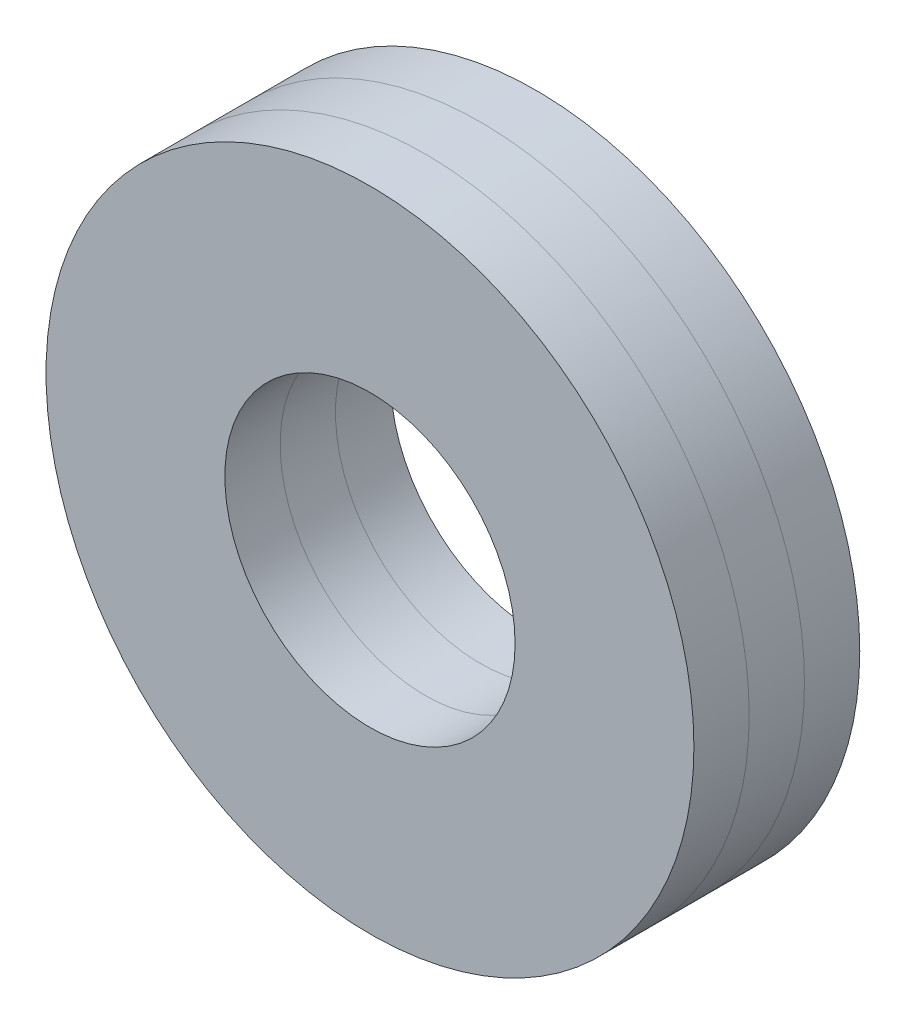
ISO-10303-21;
HEADER;
FILE_DESCRIPTION(('STEP AP214'),'2;1');
FILE_NAME('part.step','',(''),(''),'','','');
FILE_SCHEMA(('AUTOMOTIVE_DESIGN { 1 0 10303 214 1 1 1 1 }'));
ENDSEC;
DATA;
#1=APPLICATION_CONTEXT('core data for automotive mechanical design processes');
#2=APPLICATION_PROTOCOL_DEFINITION('international standard','automotive_design',2000,#1);
#3=PRODUCT_CONTEXT('',#1,'mechanical');
#4=PRODUCT('Part','Part','',(#3));
#5=PRODUCT_RELATED_PRODUCT_CATEGORY('part','',(#4));
#6=PRODUCT_DEFINITION_FORMATION('','',#4);
#7=PRODUCT_DEFINITION_CONTEXT('part definition',#1,'design');
#8=PRODUCT_DEFINITION('design','',#6,#7);
#9=PRODUCT_DEFINITION_SHAPE('','',#8);
#10=(LENGTH_UNIT() NAMED_UNIT(*) SI_UNIT(.MILLI.,.METRE.));
#11=(NAMED_UNIT(*) PLANE_ANGLE_UNIT() SI_UNIT($,.RADIAN.));
#12=(NAMED_UNIT(*) SI_UNIT($,.STERADIAN.) SOLID_ANGLE_UNIT());
#13=UNCERTAINTY_MEASURE_WITH_UNIT(LENGTH_MEASURE(1.E-05),#10,'distance_accuracy_value','');
#14=(GEOMETRIC_REPRESENTATION_CONTEXT(3) GLOBAL_UNCERTAINTY_ASSIGNED_CONTEXT((#13)) GLOBAL_UNIT_ASSIGNED_CONTEXT((#10,
#11,#12)) REPRESENTATION_CONTEXT('',''));
#15=CARTESIAN_POINT('',(0.,0.,0.));
#16=DIRECTION('',(0.,0.,1.));
#17=DIRECTION('',(1.,0.,0.));
#18=AXIS2_PLACEMENT_3D('',#15,#16,#17);
#19=CARTESIAN_POINT('',(0.,0.,-1.6256));
#20=DIRECTION('',(0.,0.,1.));
#21=DIRECTION('',(1.,0.,0.));
#22=AXIS2_PLACEMENT_3D('',#19,#20,#21);
#23=PLANE('',#22);
#24=CARTESIAN_POINT('',(0.,0.,-1.6256));
#25=DIRECTION('',(0.,0.,1.));
#26=DIRECTION('',(1.,0.,0.));
#27=AXIS2_PLACEMENT_3D('',#24,#25,#26);
#28=CIRCLE('',#27,2.1336);
#29=CARTESIAN_POINT('',(2.1336,0.,-1.6256));
#30=VERTEX_POINT('',#29);
#31=EDGE_CURVE('E48',#30,#30,#28,.F.);
#32=ORIENTED_EDGE('',*,*,#31,.T.);
#33=EDGE_LOOP('',(#32));
#34=FACE_BOUND('',#33,.T.);
#35=CARTESIAN_POINT('',(0.,0.,-1.6256));
#36=DIRECTION('',(0.,0.,1.));
#37=DIRECTION('',(1.,0.,0.));
#38=AXIS2_PLACEMENT_3D('',#35,#36,#37);
#39=CIRCLE('',#38,4.7625);
#40=CARTESIAN_POINT('',(4.7625,0.,-1.6256));
#41=VERTEX_POINT('',#40);
#42=EDGE_CURVE('E57',#41,#41,#39,.F.);
#43=ORIENTED_EDGE('',*,*,#42,.F.);
#44=EDGE_LOOP('',(#43));
#45=FACE_BOUND('',#44,.T.);
#46=ADVANCED_FACE('F44',(#34,#45),#23,.T.);
#47=CARTESIAN_POINT('',(0.,0.,-2.4384));
#48=DIRECTION('',(0.,0.,1.));
#49=DIRECTION('',(1.,0.,0.));
#50=AXIS2_PLACEMENT_3D('',#47,#48,#49);
#51=PLANE('',#50);
#52=CARTESIAN_POINT('',(0.,0.,-2.4384));
#53=DIRECTION('',(0.,0.,1.));
#54=DIRECTION('',(1.,0.,0.));
#55=AXIS2_PLACEMENT_3D('',#52,#53,#54);
#56=CIRCLE('',#55,2.1336);
#57=CARTESIAN_POINT('',(2.1336,0.,-2.4384));
#58=VERTEX_POINT('',#57);
#59=EDGE_CURVE('E12',#58,#58,#56,.T.);
#60=ORIENTED_EDGE('',*,*,#59,.T.);
#61=EDGE_LOOP('',(#60));
#62=FACE_BOUND('',#61,.T.);
#63=CARTESIAN_POINT('',(0.,0.,-2.4384));
#64=DIRECTION('',(0.,0.,1.));
#65=DIRECTION('',(1.,0.,0.));
#66=AXIS2_PLACEMENT_3D('',#63,#64,#65);
#67=CIRCLE('',#66,4.7625);
#68=CARTESIAN_POINT('',(4.7625,0.,-2.4384));
#69=VERTEX_POINT('',#68);
#70=EDGE_CURVE('E52',#69,#69,#67,.T.);
#71=ORIENTED_EDGE('',*,*,#70,.F.);
#72=EDGE_LOOP('',(#71));
#73=FACE_BOUND('',#72,.T.);
#74=ADVANCED_FACE('F69',(#62,#73),#51,.F.);
#75=CARTESIAN_POINT('',(0.,0.,-2.4384));
#76=DIRECTION('',(0.,0.,1.));
#77=DIRECTION('',(1.,0.,0.));
#78=AXIS2_PLACEMENT_3D('',#75,#76,#77);
#79=CYLINDRICAL_SURFACE('',#78,2.1336);
#80=ORIENTED_EDGE('',*,*,#59,.F.);
#81=EDGE_LOOP('',(#80));
#82=FACE_BOUND('',#81,.T.);
#83=ORIENTED_EDGE('',*,*,#31,.F.);
#84=EDGE_LOOP('',(#83));
#85=FACE_BOUND('',#84,.T.);
#86=ADVANCED_FACE('F67',(#82,#85),#79,.F.);
#87=CARTESIAN_POINT('',(0.,0.,-2.4384));
#88=DIRECTION('',(0.,0.,1.));
#89=DIRECTION('',(1.,0.,0.));
#90=AXIS2_PLACEMENT_3D('',#87,#88,#89);
#91=CYLINDRICAL_SURFACE('',#90,4.7625);
#92=ORIENTED_EDGE('',*,*,#70,.T.);
#93=EDGE_LOOP('',(#92));
#94=FACE_BOUND('',#93,.T.);
#95=ORIENTED_EDGE('',*,*,#42,.T.);
#96=EDGE_LOOP('',(#95));
#97=FACE_BOUND('',#96,.T.);
#98=ADVANCED_FACE('F46',(#94,#97),#91,.T.);
#99=CLOSED_SHELL('',(#46,#74,#86,#98));
#100=MANIFOLD_SOLID_BREP('B2',#99);
#101=CARTESIAN_POINT('',(0.,0.,-0.8128));
#102=DIRECTION('',(0.,0.,1.));
#103=DIRECTION('',(1.,0.,0.));
#104=AXIS2_PLACEMENT_3D('',#101,#102,#103);
#105=PLANE('',#104);
#106=CARTESIAN_POINT('',(0.,0.,-0.8128));
#107=DIRECTION('',(0.,0.,1.));
#108=DIRECTION('',(1.,0.,0.));
#109=AXIS2_PLACEMENT_3D('',#106,#107,#108);
#110=CIRCLE('',#109,4.7625);
#111=CARTESIAN_POINT('',(4.7625,0.,-0.8128));
#112=VERTEX_POINT('',#111);
#113=EDGE_CURVE('E117',#112,#112,#110,.F.);
#114=ORIENTED_EDGE('',*,*,#113,.T.);
#115=EDGE_LOOP('',(#114));
#116=FACE_BOUND('',#115,.T.);
#117=CARTESIAN_POINT('',(0.,0.,-0.8128));
#118=DIRECTION('',(0.,0.,1.));
#119=DIRECTION('',(1.,0.,0.));
#120=AXIS2_PLACEMENT_3D('',#117,#118,#119);
#121=CIRCLE('',#120,2.1336);
#122=CARTESIAN_POINT('',(2.1336,0.,-0.8128));
#123=VERTEX_POINT('',#122);
#124=EDGE_CURVE('E126',#123,#123,#121,.F.);
#125=ORIENTED_EDGE('',*,*,#124,.F.);
#126=EDGE_LOOP('',(#125));
#127=FACE_BOUND('',#126,.T.);
#128=ADVANCED_FACE('F113',(#116,#127),#105,.F.);
#129=CARTESIAN_POINT('',(0.,0.,0.));
#130=DIRECTION('',(0.,0.,1.));
#131=DIRECTION('',(1.,0.,0.));
#132=AXIS2_PLACEMENT_3D('',#129,#130,#131);
#133=PLANE('',#132);
#134=CARTESIAN_POINT('',(0.,0.,0.));
#135=DIRECTION('',(0.,0.,1.));
#136=DIRECTION('',(1.,0.,0.));
#137=AXIS2_PLACEMENT_3D('',#134,#135,#136);
#138=CIRCLE('',#137,2.1336);
#139=CARTESIAN_POINT('',(2.1336,0.,0.));
#140=VERTEX_POINT('',#139);
#141=EDGE_CURVE('E43',#140,#140,#138,.T.);
#142=ORIENTED_EDGE('',*,*,#141,.F.);
#143=EDGE_LOOP('',(#142));
#144=FACE_BOUND('',#143,.T.);
#145=CARTESIAN_POINT('',(0.,0.,0.));
#146=DIRECTION('',(0.,0.,1.));
#147=DIRECTION('',(1.,0.,0.));
#148=AXIS2_PLACEMENT_3D('',#145,#146,#147);
#149=CIRCLE('',#148,4.7625);
#150=CARTESIAN_POINT('',(4.7625,0.,0.));
#151=VERTEX_POINT('',#150);
#152=EDGE_CURVE('E121',#151,#151,#149,.T.);
#153=ORIENTED_EDGE('',*,*,#152,.T.);
#154=EDGE_LOOP('',(#153));
#155=FACE_BOUND('',#154,.T.);
#156=ADVANCED_FACE('F141',(#144,#155),#133,.T.);
#157=CARTESIAN_POINT('',(0.,0.,-2.4384));
#158=DIRECTION('',(0.,0.,1.));
#159=DIRECTION('',(1.,0.,0.));
#160=AXIS2_PLACEMENT_3D('',#157,#158,#159);
#161=CYLINDRICAL_SURFACE('',#160,2.1336);
#162=ORIENTED_EDGE('',*,*,#124,.T.);
#163=EDGE_LOOP('',(#162));
#164=FACE_BOUND('',#163,.T.);
#165=ORIENTED_EDGE('',*,*,#141,.T.);
#166=EDGE_LOOP('',(#165));
#167=FACE_BOUND('',#166,.T.);
#168=ADVANCED_FACE('F138',(#164,#167),#161,.F.);
#169=CARTESIAN_POINT('',(0.,0.,-2.4384));
#170=DIRECTION('',(0.,0.,1.));
#171=DIRECTION('',(1.,0.,0.));
#172=AXIS2_PLACEMENT_3D('',#169,#170,#171);
#173=CYLINDRICAL_SURFACE('',#172,4.7625);
#174=ORIENTED_EDGE('',*,*,#113,.F.);
#175=EDGE_LOOP('',(#174));
#176=FACE_BOUND('',#175,.T.);
#177=ORIENTED_EDGE('',*,*,#152,.F.);
#178=EDGE_LOOP('',(#177));
#179=FACE_BOUND('',#178,.T.);
#180=ADVANCED_FACE('F115',(#176,#179),#173,.T.);
#181=CLOSED_SHELL('',(#128,#156,#168,#180));
#182=MANIFOLD_SOLID_BREP('B7',#181);
#183=CARTESIAN_POINT('',(0.,0.,-1.6256));
#184=DIRECTION('',(0.,0.,1.));
#185=DIRECTION('',(1.,0.,0.));
#186=AXIS2_PLACEMENT_3D('',#183,#184,#185);
#187=PLANE('',#186);
#188=CARTESIAN_POINT('',(0.,0.,-1.6256));
#189=DIRECTION('',(0.,0.,1.));
#190=DIRECTION('',(1.,0.,0.));
#191=AXIS2_PLACEMENT_3D('',#188,#189,#190);
#192=CIRCLE('',#191,4.7625);
#193=CARTESIAN_POINT('',(4.7625,0.,-1.6256));
#194=VERTEX_POINT('',#193);
#195=EDGE_CURVE('E182',#194,#194,#192,.F.);
#196=ORIENTED_EDGE('',*,*,#195,.T.);
#197=EDGE_LOOP('',(#196));
#198=FACE_BOUND('',#197,.T.);
#199=CARTESIAN_POINT('',(0.,0.,-1.6256));
#200=DIRECTION('',(0.,0.,1.));
#201=DIRECTION('',(1.,0.,0.));
#202=AXIS2_PLACEMENT_3D('',#199,#200,#201);
#203=CIRCLE('',#202,2.1336);
#204=CARTESIAN_POINT('',(2.1336,0.,-1.6256));
#205=VERTEX_POINT('',#204);
#206=EDGE_CURVE('E188',#205,#205,#203,.F.);
#207=ORIENTED_EDGE('',*,*,#206,.F.);
#208=EDGE_LOOP('',(#207));
#209=FACE_BOUND('',#208,.T.);
#210=ADVANCED_FACE('F175',(#198,#209),#187,.F.);
#211=CARTESIAN_POINT('',(0.,0.,-0.8128));
#212=DIRECTION('',(0.,0.,1.));
#213=DIRECTION('',(1.,0.,0.));
#214=AXIS2_PLACEMENT_3D('',#211,#212,#213);
#215=PLANE('',#214);
#216=CARTESIAN_POINT('',(0.,0.,-0.8128));
#217=DIRECTION('',(0.,0.,1.));
#218=DIRECTION('',(1.,0.,0.));
#219=AXIS2_PLACEMENT_3D('',#216,#217,#218);
#220=CIRCLE('',#219,2.1336);
#221=CARTESIAN_POINT('',(2.1336,0.,-0.8128));
#222=VERTEX_POINT('',#221);
#223=EDGE_CURVE('E112',#222,#222,#220,.F.);
#224=ORIENTED_EDGE('',*,*,#223,.T.);
#225=EDGE_LOOP('',(#224));
#226=FACE_BOUND('',#225,.T.);
#227=CARTESIAN_POINT('',(0.,0.,-0.8128));
#228=DIRECTION('',(0.,0.,1.));
#229=DIRECTION('',(1.,0.,0.));
#230=AXIS2_PLACEMENT_3D('',#227,#228,#229);
#231=CIRCLE('',#230,4.7625);
#232=CARTESIAN_POINT('',(4.7625,0.,-0.8128));
#233=VERTEX_POINT('',#232);
#234=EDGE_CURVE('E178',#233,#233,#231,.F.);
#235=ORIENTED_EDGE('',*,*,#234,.F.);
#236=EDGE_LOOP('',(#235));
#237=FACE_BOUND('',#236,.T.);
#238=ADVANCED_FACE('F197',(#226,#237),#215,.T.);
#239=CARTESIAN_POINT('',(0.,0.,-2.4384));
#240=DIRECTION('',(0.,0.,1.));
#241=DIRECTION('',(1.,0.,0.));
#242=AXIS2_PLACEMENT_3D('',#239,#240,#241);
#243=CYLINDRICAL_SURFACE('',#242,2.1336);
#244=ORIENTED_EDGE('',*,*,#206,.T.);
#245=EDGE_LOOP('',(#244));
#246=FACE_BOUND('',#245,.T.);
#247=ORIENTED_EDGE('',*,*,#223,.F.);
#248=EDGE_LOOP('',(#247));
#249=FACE_BOUND('',#248,.T.);
#250=ADVANCED_FACE('F199',(#246,#249),#243,.F.);
#251=CARTESIAN_POINT('',(0.,0.,-2.4384));
#252=DIRECTION('',(0.,0.,1.));
#253=DIRECTION('',(1.,0.,0.));
#254=AXIS2_PLACEMENT_3D('',#251,#252,#253);
#255=CYLINDRICAL_SURFACE('',#254,4.7625);
#256=ORIENTED_EDGE('',*,*,#195,.F.);
#257=EDGE_LOOP('',(#256));
#258=FACE_BOUND('',#257,.T.);
#259=ORIENTED_EDGE('',*,*,#234,.T.);
#260=EDGE_LOOP('',(#259));
#261=FACE_BOUND('',#260,.T.);
#262=ADVANCED_FACE('F195',(#258,#261),#255,.T.);
#263=CLOSED_SHELL('',(#210,#238,#250,#262));
#264=MANIFOLD_SOLID_BREP('B38',#263);
#265=ADVANCED_BREP_SHAPE_REPRESENTATION('',(#18,#100,#182,#264),#14);
#266=SHAPE_DEFINITION_REPRESENTATION(#9,#265);
ENDSEC;
END-ISO-10303-21;
